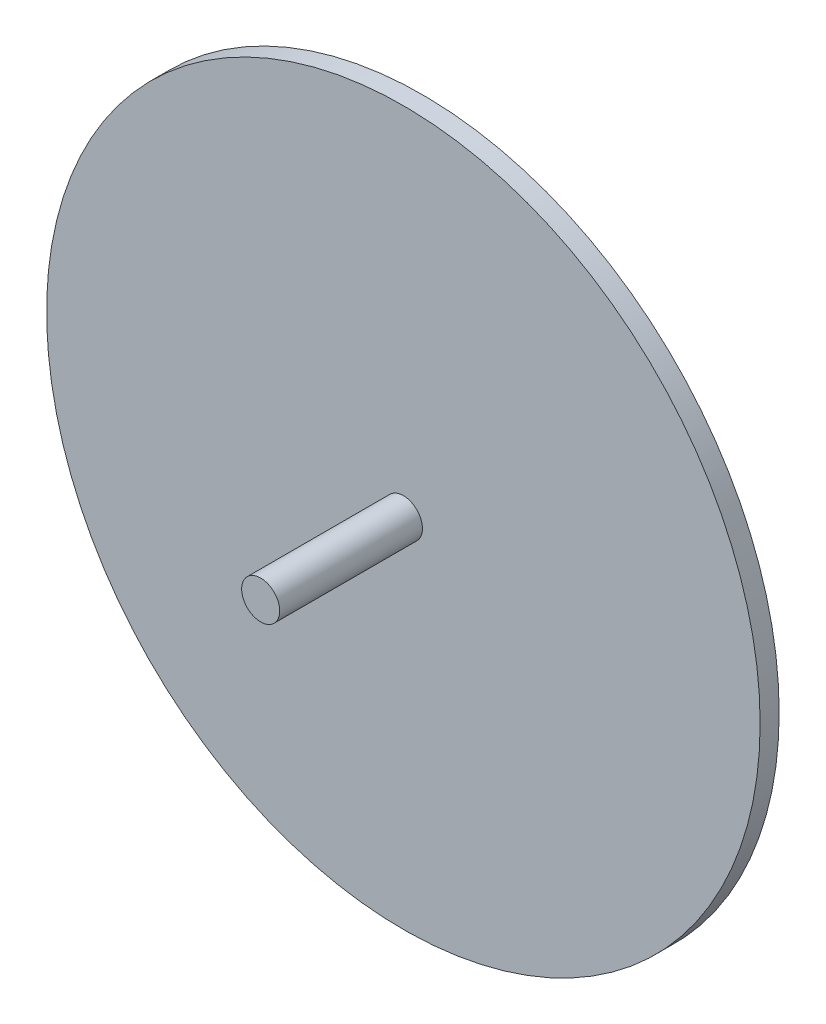
ISO-10303-21;
HEADER;
FILE_DESCRIPTION(('STEP AP214'),'2;1');
FILE_NAME('part.step','',(''),(''),'','','');
FILE_SCHEMA(('AUTOMOTIVE_DESIGN { 1 0 10303 214 1 1 1 1 }'));
ENDSEC;
DATA;
#1=APPLICATION_CONTEXT('core data for automotive mechanical design processes');
#2=APPLICATION_PROTOCOL_DEFINITION('international standard','automotive_design',2000,#1);
#3=PRODUCT_CONTEXT('',#1,'mechanical');
#4=PRODUCT('Part','Part','',(#3));
#5=PRODUCT_RELATED_PRODUCT_CATEGORY('part','',(#4));
#6=PRODUCT_DEFINITION_FORMATION('','',#4);
#7=PRODUCT_DEFINITION_CONTEXT('part definition',#1,'design');
#8=PRODUCT_DEFINITION('design','',#6,#7);
#9=PRODUCT_DEFINITION_SHAPE('','',#8);
#10=(LENGTH_UNIT() NAMED_UNIT(*) SI_UNIT(.MILLI.,.METRE.));
#11=(NAMED_UNIT(*) PLANE_ANGLE_UNIT() SI_UNIT($,.RADIAN.));
#12=(NAMED_UNIT(*) SI_UNIT($,.STERADIAN.) SOLID_ANGLE_UNIT());
#13=UNCERTAINTY_MEASURE_WITH_UNIT(LENGTH_MEASURE(1.E-05),#10,'distance_accuracy_value','');
#14=(GEOMETRIC_REPRESENTATION_CONTEXT(3) GLOBAL_UNCERTAINTY_ASSIGNED_CONTEXT((#13)) GLOBAL_UNIT_ASSIGNED_CONTEXT((#10,
#11,#12)) REPRESENTATION_CONTEXT('',''));
#15=CARTESIAN_POINT('',(0.,0.,0.));
#16=DIRECTION('',(0.,0.,1.));
#17=DIRECTION('',(1.,0.,0.));
#18=AXIS2_PLACEMENT_3D('',#15,#16,#17);
#19=CARTESIAN_POINT('',(0.,0.,4.));
#20=DIRECTION('',(0.,0.,-1.));
#21=DIRECTION('',(-1.,0.,0.));
#22=AXIS2_PLACEMENT_3D('',#19,#20,#21);
#23=CYLINDRICAL_SURFACE('',#22,75.);
#24=CARTESIAN_POINT('',(0.,0.,4.));
#25=DIRECTION('',(0.,0.,1.));
#26=DIRECTION('',(1.,0.,0.));
#27=AXIS2_PLACEMENT_3D('',#24,#25,#26);
#28=CIRCLE('',#27,75.);
#29=CARTESIAN_POINT('',(75.,0.,4.));
#30=VERTEX_POINT('',#29);
#31=EDGE_CURVE('E10',#30,#30,#28,.T.);
#32=ORIENTED_EDGE('',*,*,#31,.F.);
#33=EDGE_LOOP('',(#32));
#34=FACE_BOUND('',#33,.T.);
#35=CARTESIAN_POINT('',(0.,0.,0.));
#36=DIRECTION('',(0.,0.,1.));
#37=DIRECTION('',(1.,0.,0.));
#38=AXIS2_PLACEMENT_3D('',#35,#36,#37);
#39=CIRCLE('',#38,75.);
#40=CARTESIAN_POINT('',(75.,0.,0.));
#41=VERTEX_POINT('',#40);
#42=EDGE_CURVE('E46',#41,#41,#39,.T.);
#43=ORIENTED_EDGE('',*,*,#42,.T.);
#44=EDGE_LOOP('',(#43));
#45=FACE_BOUND('',#44,.T.);
#46=ADVANCED_FACE('F43',(#34,#45),#23,.T.);
#47=CARTESIAN_POINT('',(0.,0.,4.));
#48=DIRECTION('',(0.,0.,1.));
#49=DIRECTION('',(1.,0.,0.));
#50=AXIS2_PLACEMENT_3D('',#47,#48,#49);
#51=PLANE('',#50);
#52=CARTESIAN_POINT('',(0.,0.,4.));
#53=DIRECTION('',(0.,0.,1.));
#54=DIRECTION('',(1.,0.,0.));
#55=AXIS2_PLACEMENT_3D('',#52,#53,#54);
#56=CIRCLE('',#55,4.);
#57=CARTESIAN_POINT('',(4.,0.,4.));
#58=VERTEX_POINT('',#57);
#59=EDGE_CURVE('E57',#58,#58,#56,.T.);
#60=ORIENTED_EDGE('',*,*,#59,.F.);
#61=EDGE_LOOP('',(#60));
#62=FACE_BOUND('',#61,.T.);
#63=ORIENTED_EDGE('',*,*,#31,.T.);
#64=EDGE_LOOP('',(#63));
#65=FACE_BOUND('',#64,.T.);
#66=ADVANCED_FACE('F74',(#62,#65),#51,.T.);
#67=CARTESIAN_POINT('',(0.,0.,0.));
#68=DIRECTION('',(0.,0.,1.));
#69=DIRECTION('',(1.,0.,0.));
#70=AXIS2_PLACEMENT_3D('',#67,#68,#69);
#71=PLANE('',#70);
#72=ORIENTED_EDGE('',*,*,#42,.F.);
#73=EDGE_LOOP('',(#72));
#74=FACE_BOUND('',#73,.T.);
#75=ADVANCED_FACE('F70',(#74),#71,.F.);
#76=CARTESIAN_POINT('',(0.,0.,34.));
#77=DIRECTION('',(0.,0.,-1.));
#78=DIRECTION('',(-1.,0.,0.));
#79=AXIS2_PLACEMENT_3D('',#76,#77,#78);
#80=CYLINDRICAL_SURFACE('',#79,4.);
#81=CARTESIAN_POINT('',(0.,0.,34.));
#82=DIRECTION('',(0.,0.,1.));
#83=DIRECTION('',(1.,0.,0.));
#84=AXIS2_PLACEMENT_3D('',#81,#82,#83);
#85=CIRCLE('',#84,4.);
#86=CARTESIAN_POINT('',(4.,0.,34.));
#87=VERTEX_POINT('',#86);
#88=EDGE_CURVE('E55',#87,#87,#85,.T.);
#89=ORIENTED_EDGE('',*,*,#88,.F.);
#90=EDGE_LOOP('',(#89));
#91=FACE_BOUND('',#90,.T.);
#92=ORIENTED_EDGE('',*,*,#59,.T.);
#93=EDGE_LOOP('',(#92));
#94=FACE_BOUND('',#93,.T.);
#95=ADVANCED_FACE('F67',(#91,#94),#80,.T.);
#96=CARTESIAN_POINT('',(0.,0.,34.));
#97=DIRECTION('',(0.,0.,1.));
#98=DIRECTION('',(1.,0.,0.));
#99=AXIS2_PLACEMENT_3D('',#96,#97,#98);
#100=PLANE('',#99);
#101=ORIENTED_EDGE('',*,*,#88,.T.);
#102=EDGE_LOOP('',(#101));
#103=FACE_BOUND('',#102,.T.);
#104=ADVANCED_FACE('F65',(#103),#100,.T.);
#105=CLOSED_SHELL('',(#46,#66,#75,#95,#104));
#106=MANIFOLD_SOLID_BREP('B2',#105);
#107=ADVANCED_BREP_SHAPE_REPRESENTATION('',(#18,#106),#14);
#108=SHAPE_DEFINITION_REPRESENTATION(#9,#107);
ENDSEC;
END-ISO-10303-21;
